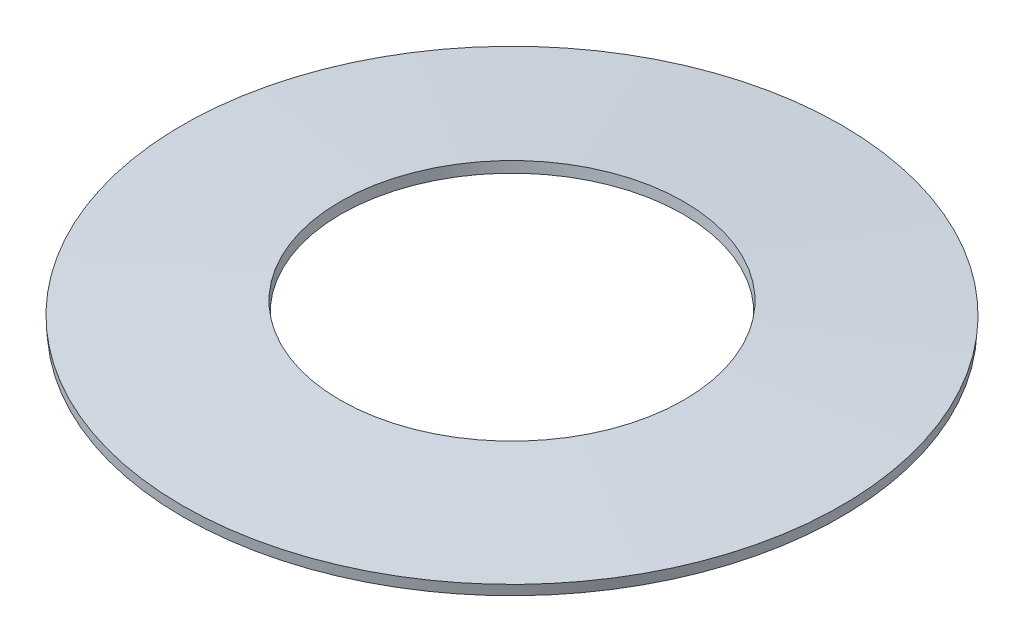
ISO-10303-21;
HEADER;
FILE_DESCRIPTION(('STEP AP214'),'2;1');
FILE_NAME('part.step','',(''),(''),'','','');
FILE_SCHEMA(('AUTOMOTIVE_DESIGN { 1 0 10303 214 1 1 1 1 }'));
ENDSEC;
DATA;
#1=APPLICATION_CONTEXT('core data for automotive mechanical design processes');
#2=APPLICATION_PROTOCOL_DEFINITION('international standard','automotive_design',2000,#1);
#3=PRODUCT_CONTEXT('',#1,'mechanical');
#4=PRODUCT('Part','Part','',(#3));
#5=PRODUCT_RELATED_PRODUCT_CATEGORY('part','',(#4));
#6=PRODUCT_DEFINITION_FORMATION('','',#4);
#7=PRODUCT_DEFINITION_CONTEXT('part definition',#1,'design');
#8=PRODUCT_DEFINITION('design','',#6,#7);
#9=PRODUCT_DEFINITION_SHAPE('','',#8);
#10=(LENGTH_UNIT() NAMED_UNIT(*) SI_UNIT(.MILLI.,.METRE.));
#11=(NAMED_UNIT(*) PLANE_ANGLE_UNIT() SI_UNIT($,.RADIAN.));
#12=(NAMED_UNIT(*) SI_UNIT($,.STERADIAN.) SOLID_ANGLE_UNIT());
#13=UNCERTAINTY_MEASURE_WITH_UNIT(LENGTH_MEASURE(1.E-05),#10,'distance_accuracy_value','');
#14=(GEOMETRIC_REPRESENTATION_CONTEXT(3) GLOBAL_UNCERTAINTY_ASSIGNED_CONTEXT((#13)) GLOBAL_UNIT_ASSIGNED_CONTEXT((#10,
#11,#12)) REPRESENTATION_CONTEXT('',''));
#15=CARTESIAN_POINT('',(0.,0.,0.));
#16=DIRECTION('',(0.,0.,1.));
#17=DIRECTION('',(1.,0.,0.));
#18=AXIS2_PLACEMENT_3D('',#15,#16,#17);
#19=CARTESIAN_POINT('',(0.,0.,0.));
#20=DIRECTION('',(0.,1.,0.));
#21=DIRECTION('',(0.,0.,1.));
#22=AXIS2_PLACEMENT_3D('',#19,#20,#21);
#23=CONICAL_SURFACE('',#22,7.88017020627382,0.0794025844507323);
#24=CARTESIAN_POINT('',(0.,0.249212317674661,0.));
#25=DIRECTION('',(0.,-1.,0.));
#26=DIRECTION('',(0.,0.,-1.));
#27=AXIS2_PLACEMENT_3D('',#24,#25,#26);
#28=CIRCLE('',#27,7.9);
#29=CARTESIAN_POINT('',(0.,0.249212317674661,-7.9));
#30=VERTEX_POINT('',#29);
#31=EDGE_CURVE('E46',#30,#30,#28,.T.);
#32=ORIENTED_EDGE('',*,*,#31,.T.);
#33=EDGE_LOOP('',(#32));
#34=FACE_BOUND('',#33,.T.);
#35=CARTESIAN_POINT('',(0.,0.,0.));
#36=DIRECTION('',(0.,-1.,0.));
#37=DIRECTION('',(0.,0.,-1.));
#38=AXIS2_PLACEMENT_3D('',#35,#36,#37);
#39=CIRCLE('',#38,7.88017020627382);
#40=CARTESIAN_POINT('',(0.,0.,-7.88017020627382));
#41=VERTEX_POINT('',#40);
#42=EDGE_CURVE('E10',#41,#41,#39,.T.);
#43=ORIENTED_EDGE('',*,*,#42,.F.);
#44=EDGE_LOOP('',(#43));
#45=FACE_BOUND('',#44,.T.);
#46=ADVANCED_FACE('F32',(#34,#45),#23,.T.);
#47=CARTESIAN_POINT('',(0.,0.300787682325335,0.));
#48=DIRECTION('',(0.,-1.,0.));
#49=DIRECTION('',(0.,0.,-1.));
#50=AXIS2_PLACEMENT_3D('',#47,#48,#49);
#51=CONICAL_SURFACE('',#50,4.1,1.49139374234414);
#52=ORIENTED_EDGE('',*,*,#42,.T.);
#53=EDGE_LOOP('',(#52));
#54=FACE_BOUND('',#53,.T.);
#55=CARTESIAN_POINT('',(0.,0.300787682325335,0.));
#56=DIRECTION('',(0.,-1.,0.));
#57=DIRECTION('',(0.,0.,-1.));
#58=AXIS2_PLACEMENT_3D('',#55,#56,#57);
#59=CIRCLE('',#58,4.1);
#60=CARTESIAN_POINT('',(0.,0.300787682325335,-4.1));
#61=VERTEX_POINT('',#60);
#62=EDGE_CURVE('E38',#61,#61,#59,.T.);
#63=ORIENTED_EDGE('',*,*,#62,.F.);
#64=EDGE_LOOP('',(#63));
#65=FACE_BOUND('',#64,.T.);
#66=ADVANCED_FACE('F62',(#54,#65),#51,.F.);
#67=CARTESIAN_POINT('',(0.,0.549999999999998,0.));
#68=DIRECTION('',(0.,1.,0.));
#69=DIRECTION('',(0.,0.,1.));
#70=AXIS2_PLACEMENT_3D('',#67,#68,#69);
#71=CONICAL_SURFACE('',#70,4.11982979372619,0.07940258445076);
#72=ORIENTED_EDGE('',*,*,#62,.T.);
#73=EDGE_LOOP('',(#72));
#74=FACE_BOUND('',#73,.T.);
#75=CARTESIAN_POINT('',(0.,0.549999999999998,0.));
#76=DIRECTION('',(0.,-1.,0.));
#77=DIRECTION('',(0.,0.,-1.));
#78=AXIS2_PLACEMENT_3D('',#75,#76,#77);
#79=CIRCLE('',#78,4.11982979372619);
#80=CARTESIAN_POINT('',(0.,0.549999999999998,-4.11982979372619));
#81=VERTEX_POINT('',#80);
#82=EDGE_CURVE('E42',#81,#81,#79,.T.);
#83=ORIENTED_EDGE('',*,*,#82,.F.);
#84=EDGE_LOOP('',(#83));
#85=FACE_BOUND('',#84,.T.);
#86=ADVANCED_FACE('F56',(#74,#85),#71,.F.);
#87=CARTESIAN_POINT('',(0.,0.249212317674661,0.));
#88=DIRECTION('',(0.,-1.,0.));
#89=DIRECTION('',(0.,0.,-1.));
#90=AXIS2_PLACEMENT_3D('',#87,#88,#89);
#91=CONICAL_SURFACE('',#90,7.9,1.49139374234414);
#92=ORIENTED_EDGE('',*,*,#82,.T.);
#93=EDGE_LOOP('',(#92));
#94=FACE_BOUND('',#93,.T.);
#95=ORIENTED_EDGE('',*,*,#31,.F.);
#96=EDGE_LOOP('',(#95));
#97=FACE_BOUND('',#96,.T.);
#98=ADVANCED_FACE('F54',(#94,#97),#91,.T.);
#99=CLOSED_SHELL('',(#46,#66,#86,#98));
#100=MANIFOLD_SOLID_BREP('B2',#99);
#101=ADVANCED_BREP_SHAPE_REPRESENTATION('',(#18,#100),#14);
#102=SHAPE_DEFINITION_REPRESENTATION(#9,#101);
ENDSEC;
END-ISO-10303-21;
